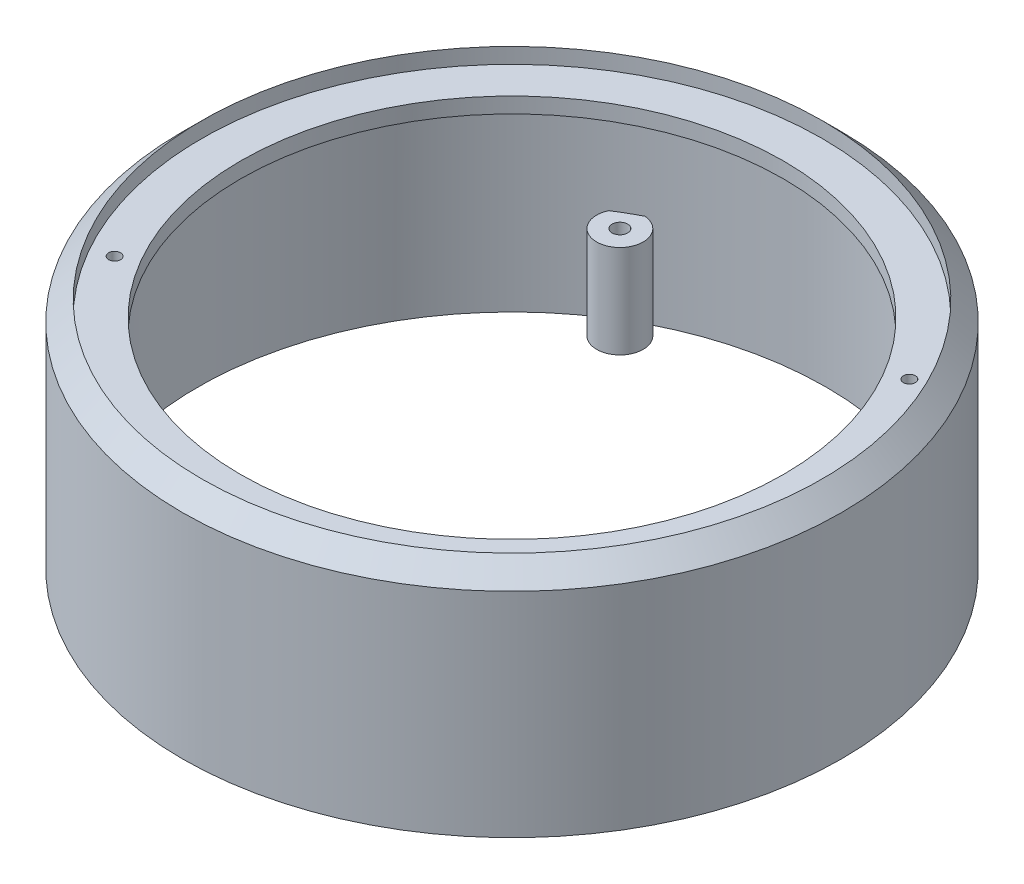
ISO-10303-21;
HEADER;
FILE_DESCRIPTION(('STEP AP214'),'2;1');
FILE_NAME('part.step','',(''),(''),'','','');
FILE_SCHEMA(('AUTOMOTIVE_DESIGN { 1 0 10303 214 1 1 1 1 }'));
ENDSEC;
DATA;
#1=APPLICATION_CONTEXT('core data for automotive mechanical design processes');
#2=APPLICATION_PROTOCOL_DEFINITION('international standard','automotive_design',2000,#1);
#3=PRODUCT_CONTEXT('',#1,'mechanical');
#4=PRODUCT('Part','Part','',(#3));
#5=PRODUCT_RELATED_PRODUCT_CATEGORY('part','',(#4));
#6=PRODUCT_DEFINITION_FORMATION('','',#4);
#7=PRODUCT_DEFINITION_CONTEXT('part definition',#1,'design');
#8=PRODUCT_DEFINITION('design','',#6,#7);
#9=PRODUCT_DEFINITION_SHAPE('','',#8);
#10=(LENGTH_UNIT() NAMED_UNIT(*) SI_UNIT(.MILLI.,.METRE.));
#11=(NAMED_UNIT(*) PLANE_ANGLE_UNIT() SI_UNIT($,.RADIAN.));
#12=(NAMED_UNIT(*) SI_UNIT($,.STERADIAN.) SOLID_ANGLE_UNIT());
#13=UNCERTAINTY_MEASURE_WITH_UNIT(LENGTH_MEASURE(1.E-05),#10,'distance_accuracy_value','');
#14=(GEOMETRIC_REPRESENTATION_CONTEXT(3) GLOBAL_UNCERTAINTY_ASSIGNED_CONTEXT((#13)) GLOBAL_UNIT_ASSIGNED_CONTEXT((#10,
#11,#12)) REPRESENTATION_CONTEXT('',''));
#15=CARTESIAN_POINT('',(0.,0.,0.));
#16=DIRECTION('',(0.,0.,1.));
#17=DIRECTION('',(1.,0.,0.));
#18=AXIS2_PLACEMENT_3D('',#15,#16,#17);
#19=CARTESIAN_POINT('',(-85.,0.,0.));
#20=DIRECTION('',(0.,1.,0.));
#21=DIRECTION('',(0.,0.,1.));
#22=AXIS2_PLACEMENT_3D('',#19,#20,#21);
#23=PLANE('',#22);
#24=CARTESIAN_POINT('',(0.,0.,0.));
#25=DIRECTION('',(0.,-1.,0.));
#26=DIRECTION('',(0.,0.,-1.));
#27=AXIS2_PLACEMENT_3D('',#24,#25,#26);
#28=CIRCLE('',#27,81.);
#29=CARTESIAN_POINT('',(-43.4284127716312,0.,68.3737739497888));
#30=VERTEX_POINT('',#29);
#31=CARTESIAN_POINT('',(-43.4284127716321,0.,-68.3737739497882));
#32=VERTEX_POINT('',#31);
#33=EDGE_CURVE('E11',#30,#32,#28,.T.);
#34=ORIENTED_EDGE('',*,*,#33,.F.);
#35=CARTESIAN_POINT('',(-37.9999999999994,0.,65.8179306876177));
#36=DIRECTION('',(0.,-1.,0.));
#37=DIRECTION('',(0.,0.,-1.));
#38=AXIS2_PLACEMENT_3D('',#35,#36,#37);
#39=CIRCLE('',#38,6.00000000000006);
#40=CARTESIAN_POINT('',(-37.4992188073149,0.,71.7969956811643));
#41=VERTEX_POINT('',#40);
#42=EDGE_CURVE('E89',#30,#41,#39,.T.);
#43=ORIENTED_EDGE('',*,*,#42,.T.);
#44=CARTESIAN_POINT('',(80.9276315789474,0.,3.4232217313755));
#45=VERTEX_POINT('',#44);
#46=EDGE_CURVE('E42',#45,#41,#28,.T.);
#47=ORIENTED_EDGE('',*,*,#46,.F.);
#48=CARTESIAN_POINT('',(76.,0.,0.));
#49=DIRECTION('',(0.,-1.,0.));
#50=DIRECTION('',(0.,0.,-1.));
#51=AXIS2_PLACEMENT_3D('',#48,#49,#50);
#52=CIRCLE('',#51,6.00000000000006);
#53=CARTESIAN_POINT('',(80.9276315789474,0.,-3.4232217313755));
#54=VERTEX_POINT('',#53);
#55=EDGE_CURVE('E87',#45,#54,#52,.T.);
#56=ORIENTED_EDGE('',*,*,#55,.T.);
#57=CARTESIAN_POINT('',(-37.4992188073159,0.,-71.7969956811638));
#58=VERTEX_POINT('',#57);
#59=EDGE_CURVE('E41',#58,#54,#28,.T.);
#60=ORIENTED_EDGE('',*,*,#59,.F.);
#61=CARTESIAN_POINT('',(-38.0000000000003,0.,-65.8179306876172));
#62=DIRECTION('',(0.,-1.,0.));
#63=DIRECTION('',(0.,0.,-1.));
#64=AXIS2_PLACEMENT_3D('',#61,#62,#63);
#65=CIRCLE('',#64,6.00000000000007);
#66=EDGE_CURVE('E116',#58,#32,#65,.T.);
#67=ORIENTED_EDGE('',*,*,#66,.T.);
#68=EDGE_LOOP('',(#34,#43,#47,#56,#60,#67));
#69=FACE_BOUND('',#68,.T.);
#70=CARTESIAN_POINT('',(0.,0.,0.));
#71=DIRECTION('',(0.,-1.,0.));
#72=DIRECTION('',(0.,0.,-1.));
#73=AXIS2_PLACEMENT_3D('',#70,#71,#72);
#74=CIRCLE('',#73,85.);
#75=CARTESIAN_POINT('',(0.,0.,-85.));
#76=VERTEX_POINT('',#75);
#77=EDGE_CURVE('E148',#76,#76,#74,.T.);
#78=ORIENTED_EDGE('',*,*,#77,.T.);
#79=EDGE_LOOP('',(#78));
#80=FACE_BOUND('',#79,.T.);
#81=CARTESIAN_POINT('',(-37.9999999999994,0.,65.8179306876177));
#82=DIRECTION('',(0.,-1.,0.));
#83=DIRECTION('',(0.,0.,-1.));
#84=AXIS2_PLACEMENT_3D('',#81,#82,#83);
#85=CIRCLE('',#84,2.);
#86=CARTESIAN_POINT('',(-37.9999999999994,0.,63.8179306876177));
#87=VERTEX_POINT('',#86);
#88=EDGE_CURVE('E130',#87,#87,#85,.T.);
#89=ORIENTED_EDGE('',*,*,#88,.F.);
#90=EDGE_LOOP('',(#89));
#91=FACE_BOUND('',#90,.T.);
#92=CARTESIAN_POINT('',(-38.0000000000003,0.,-65.8179306876172));
#93=DIRECTION('',(0.,-1.,0.));
#94=DIRECTION('',(0.,0.,-1.));
#95=AXIS2_PLACEMENT_3D('',#92,#93,#94);
#96=CIRCLE('',#95,2.);
#97=CARTESIAN_POINT('',(-38.0000000000003,0.,-67.8179306876172));
#98=VERTEX_POINT('',#97);
#99=EDGE_CURVE('E110',#98,#98,#96,.T.);
#100=ORIENTED_EDGE('',*,*,#99,.F.);
#101=EDGE_LOOP('',(#100));
#102=FACE_BOUND('',#101,.T.);
#103=CARTESIAN_POINT('',(76.,0.,0.));
#104=DIRECTION('',(0.,-1.,0.));
#105=DIRECTION('',(0.,0.,-1.));
#106=AXIS2_PLACEMENT_3D('',#103,#104,#105);
#107=CIRCLE('',#106,2.);
#108=CARTESIAN_POINT('',(76.,0.,-2.));
#109=VERTEX_POINT('',#108);
#110=EDGE_CURVE('E101',#109,#109,#107,.T.);
#111=ORIENTED_EDGE('',*,*,#110,.F.);
#112=EDGE_LOOP('',(#111));
#113=FACE_BOUND('',#112,.T.);
#114=ADVANCED_FACE('F34',(#69,#80,#91,#102,#113),#23,.F.);
#115=CARTESIAN_POINT('',(0.,-62.4634869454388,0.));
#116=DIRECTION('',(0.,-1.,0.));
#117=DIRECTION('',(0.,0.,-1.));
#118=AXIS2_PLACEMENT_3D('',#115,#116,#117);
#119=CYLINDRICAL_SURFACE('',#118,81.);
#120=CARTESIAN_POINT('',(0.,52.,0.));
#121=DIRECTION('',(0.,-1.,0.));
#122=DIRECTION('',(0.,0.,-1.));
#123=AXIS2_PLACEMENT_3D('',#120,#121,#122);
#124=CIRCLE('',#123,81.);
#125=CARTESIAN_POINT('',(0.,52.,-81.));
#126=VERTEX_POINT('',#125);
#127=EDGE_CURVE('E91',#126,#126,#124,.T.);
#128=ORIENTED_EDGE('',*,*,#127,.F.);
#129=EDGE_LOOP('',(#128));
#130=FACE_BOUND('',#129,.T.);
#131=CARTESIAN_POINT('',(0.,24.,0.));
#132=DIRECTION('',(0.,-1.,0.));
#133=DIRECTION('',(0.,0.,-1.));
#134=AXIS2_PLACEMENT_3D('',#131,#132,#133);
#135=CIRCLE('',#134,81.);
#136=CARTESIAN_POINT('',(80.9276315789474,24.,3.4232217313755));
#137=VERTEX_POINT('',#136);
#138=CARTESIAN_POINT('',(80.9276315789474,24.,-3.4232217313755));
#139=VERTEX_POINT('',#138);
#140=EDGE_CURVE('E53',#137,#139,#135,.F.);
#141=ORIENTED_EDGE('',*,*,#140,.F.);
#142=DIRECTION('',(0.,-1.,0.));
#143=VECTOR('',#142,1.);
#144=CARTESIAN_POINT('',(80.9276315789474,24.,3.4232217313755));
#145=LINE('',#144,#143);
#146=EDGE_CURVE('E92',#137,#45,#145,.T.);
#147=ORIENTED_EDGE('',*,*,#146,.T.);
#148=ORIENTED_EDGE('',*,*,#46,.T.);
#149=DIRECTION('',(0.,-1.,0.));
#150=VECTOR('',#149,1.);
#151=CARTESIAN_POINT('',(-37.4992188073149,24.,71.7969956811643));
#152=LINE('',#151,#150);
#153=CARTESIAN_POINT('',(-37.4992188073149,24.,71.7969956811643));
#154=VERTEX_POINT('',#153);
#155=EDGE_CURVE('E146',#154,#41,#152,.T.);
#156=ORIENTED_EDGE('',*,*,#155,.F.);
#157=CARTESIAN_POINT('',(0.,24.,0.));
#158=DIRECTION('',(0.,-1.,0.));
#159=DIRECTION('',(0.,0.,-1.));
#160=AXIS2_PLACEMENT_3D('',#157,#158,#159);
#161=CIRCLE('',#160,81.);
#162=CARTESIAN_POINT('',(-43.4284127716312,24.,68.3737739497888));
#163=VERTEX_POINT('',#162);
#164=EDGE_CURVE('E136',#163,#154,#161,.F.);
#165=ORIENTED_EDGE('',*,*,#164,.F.);
#166=DIRECTION('',(0.,-1.,0.));
#167=VECTOR('',#166,1.);
#168=CARTESIAN_POINT('',(-43.4284127716312,24.,68.3737739497888));
#169=LINE('',#168,#167);
#170=EDGE_CURVE('E142',#163,#30,#169,.T.);
#171=ORIENTED_EDGE('',*,*,#170,.T.);
#172=ORIENTED_EDGE('',*,*,#33,.T.);
#173=DIRECTION('',(0.,-1.,0.));
#174=VECTOR('',#173,1.);
#175=CARTESIAN_POINT('',(-43.4284127716321,24.,-68.3737739497882));
#176=LINE('',#175,#174);
#177=CARTESIAN_POINT('',(-43.4284127716321,24.,-68.3737739497882));
#178=VERTEX_POINT('',#177);
#179=EDGE_CURVE('E127',#178,#32,#176,.T.);
#180=ORIENTED_EDGE('',*,*,#179,.F.);
#181=CARTESIAN_POINT('',(0.,24.,0.));
#182=DIRECTION('',(0.,-1.,0.));
#183=DIRECTION('',(0.,0.,-1.));
#184=AXIS2_PLACEMENT_3D('',#181,#182,#183);
#185=CIRCLE('',#184,81.);
#186=CARTESIAN_POINT('',(-37.4992188073159,24.,-71.7969956811638));
#187=VERTEX_POINT('',#186);
#188=EDGE_CURVE('E115',#187,#178,#185,.F.);
#189=ORIENTED_EDGE('',*,*,#188,.F.);
#190=DIRECTION('',(0.,-1.,0.));
#191=VECTOR('',#190,1.);
#192=CARTESIAN_POINT('',(-37.4992188073159,24.,-71.7969956811638));
#193=LINE('',#192,#191);
#194=EDGE_CURVE('E122',#187,#58,#193,.T.);
#195=ORIENTED_EDGE('',*,*,#194,.T.);
#196=ORIENTED_EDGE('',*,*,#59,.T.);
#197=DIRECTION('',(0.,-1.,0.));
#198=VECTOR('',#197,1.);
#199=CARTESIAN_POINT('',(80.9276315789474,24.,-3.4232217313755));
#200=LINE('',#199,#198);
#201=EDGE_CURVE('E49',#139,#54,#200,.T.);
#202=ORIENTED_EDGE('',*,*,#201,.F.);
#203=EDGE_LOOP('',(#141,#147,#148,#156,#165,#171,#172,#180,#189,#195,#196,#202));
#204=FACE_BOUND('',#203,.T.);
#205=ADVANCED_FACE('F93',(#130,#204),#119,.F.);
#206=CARTESIAN_POINT('',(-81.,52.,0.));
#207=DIRECTION('',(0.,1.,0.));
#208=DIRECTION('',(0.,0.,1.));
#209=AXIS2_PLACEMENT_3D('',#206,#207,#208);
#210=PLANE('',#209);
#211=CARTESIAN_POINT('',(-64.9519052838328,52.,37.5000000000001));
#212=DIRECTION('',(0.,1.,0.));
#213=DIRECTION('',(0.,0.,1.));
#214=AXIS2_PLACEMENT_3D('',#211,#212,#213);
#215=CIRCLE('',#214,1.54999999999999);
#216=CARTESIAN_POINT('',(-64.9519052838328,52.,39.0500000000001));
#217=VERTEX_POINT('',#216);
#218=EDGE_CURVE('E106',#217,#217,#215,.T.);
#219=ORIENTED_EDGE('',*,*,#218,.T.);
#220=EDGE_LOOP('',(#219));
#221=FACE_BOUND('',#220,.T.);
#222=CARTESIAN_POINT('',(64.9519052838329,52.,-37.5000000000001));
#223=DIRECTION('',(0.,1.,0.));
#224=DIRECTION('',(0.,0.,1.));
#225=AXIS2_PLACEMENT_3D('',#222,#223,#224);
#226=CIRCLE('',#225,1.54999999999999);
#227=CARTESIAN_POINT('',(64.9519052838329,52.,-35.9500000000001));
#228=VERTEX_POINT('',#227);
#229=EDGE_CURVE('E249',#228,#228,#226,.T.);
#230=ORIENTED_EDGE('',*,*,#229,.T.);
#231=EDGE_LOOP('',(#230));
#232=FACE_BOUND('',#231,.T.);
#233=CARTESIAN_POINT('',(0.,52.,0.));
#234=DIRECTION('',(0.,-1.,0.));
#235=DIRECTION('',(0.,0.,-1.));
#236=AXIS2_PLACEMENT_3D('',#233,#234,#235);
#237=CIRCLE('',#236,70.);
#238=CARTESIAN_POINT('',(0.,52.,-70.));
#239=VERTEX_POINT('',#238);
#240=EDGE_CURVE('E165',#239,#239,#237,.T.);
#241=ORIENTED_EDGE('',*,*,#240,.F.);
#242=EDGE_LOOP('',(#241));
#243=FACE_BOUND('',#242,.T.);
#244=ORIENTED_EDGE('',*,*,#127,.T.);
#245=EDGE_LOOP('',(#244));
#246=FACE_BOUND('',#245,.T.);
#247=ADVANCED_FACE('F170',(#221,#232,#243,#246),#210,.F.);
#248=CARTESIAN_POINT('',(0.,-62.4634869454388,0.));
#249=DIRECTION('',(0.,-1.,0.));
#250=DIRECTION('',(0.,0.,-1.));
#251=AXIS2_PLACEMENT_3D('',#248,#249,#250);
#252=CYLINDRICAL_SURFACE('',#251,70.);
#253=CARTESIAN_POINT('',(0.,56.,0.));
#254=DIRECTION('',(0.,-1.,0.));
#255=DIRECTION('',(0.,0.,-1.));
#256=AXIS2_PLACEMENT_3D('',#253,#254,#255);
#257=CIRCLE('',#256,70.);
#258=CARTESIAN_POINT('',(0.,56.,-70.));
#259=VERTEX_POINT('',#258);
#260=EDGE_CURVE('E162',#259,#259,#257,.T.);
#261=ORIENTED_EDGE('',*,*,#260,.F.);
#262=EDGE_LOOP('',(#261));
#263=FACE_BOUND('',#262,.T.);
#264=ORIENTED_EDGE('',*,*,#240,.T.);
#265=EDGE_LOOP('',(#264));
#266=FACE_BOUND('',#265,.T.);
#267=ADVANCED_FACE('F177',(#263,#266),#252,.F.);
#268=CARTESIAN_POINT('',(-70.,56.,0.));
#269=DIRECTION('',(0.,-1.,0.));
#270=DIRECTION('',(0.,0.,-1.));
#271=AXIS2_PLACEMENT_3D('',#268,#269,#270);
#272=PLANE('',#271);
#273=CARTESIAN_POINT('',(-64.9519052838328,56.,37.5000000000001));
#274=DIRECTION('',(0.,1.,0.));
#275=DIRECTION('',(0.,0.,1.));
#276=AXIS2_PLACEMENT_3D('',#273,#274,#275);
#277=CIRCLE('',#276,1.54999999999999);
#278=CARTESIAN_POINT('',(-64.9519052838328,56.,39.0500000000001));
#279=VERTEX_POINT('',#278);
#280=EDGE_CURVE('E246',#279,#279,#277,.T.);
#281=ORIENTED_EDGE('',*,*,#280,.F.);
#282=EDGE_LOOP('',(#281));
#283=FACE_BOUND('',#282,.T.);
#284=CARTESIAN_POINT('',(64.9519052838329,56.,-37.5000000000001));
#285=DIRECTION('',(0.,1.,0.));
#286=DIRECTION('',(0.,0.,1.));
#287=AXIS2_PLACEMENT_3D('',#284,#285,#286);
#288=CIRCLE('',#287,1.54999999999999);
#289=CARTESIAN_POINT('',(64.9519052838329,56.,-35.9500000000001));
#290=VERTEX_POINT('',#289);
#291=EDGE_CURVE('E256',#290,#290,#288,.T.);
#292=ORIENTED_EDGE('',*,*,#291,.F.);
#293=EDGE_LOOP('',(#292));
#294=FACE_BOUND('',#293,.T.);
#295=CARTESIAN_POINT('',(0.,56.,0.));
#296=DIRECTION('',(0.,-1.,0.));
#297=DIRECTION('',(0.,0.,-1.));
#298=AXIS2_PLACEMENT_3D('',#295,#296,#297);
#299=CIRCLE('',#298,80.);
#300=CARTESIAN_POINT('',(0.,56.,-80.));
#301=VERTEX_POINT('',#300);
#302=EDGE_CURVE('E159',#301,#301,#299,.T.);
#303=ORIENTED_EDGE('',*,*,#302,.F.);
#304=EDGE_LOOP('',(#303));
#305=FACE_BOUND('',#304,.T.);
#306=ORIENTED_EDGE('',*,*,#260,.T.);
#307=EDGE_LOOP('',(#306));
#308=FACE_BOUND('',#307,.T.);
#309=ADVANCED_FACE('F183',(#283,#294,#305,#308),#272,.F.);
#310=CARTESIAN_POINT('',(0.,-62.4634869454388,0.));
#311=DIRECTION('',(0.,-1.,0.));
#312=DIRECTION('',(0.,0.,-1.));
#313=AXIS2_PLACEMENT_3D('',#310,#311,#312);
#314=CYLINDRICAL_SURFACE('',#313,80.);
#315=CARTESIAN_POINT('',(0.,60.,0.));
#316=DIRECTION('',(0.,-1.,0.));
#317=DIRECTION('',(0.,0.,-1.));
#318=AXIS2_PLACEMENT_3D('',#315,#316,#317);
#319=CIRCLE('',#318,80.);
#320=CARTESIAN_POINT('',(0.,60.,-80.));
#321=VERTEX_POINT('',#320);
#322=EDGE_CURVE('E156',#321,#321,#319,.T.);
#323=ORIENTED_EDGE('',*,*,#322,.F.);
#324=EDGE_LOOP('',(#323));
#325=FACE_BOUND('',#324,.T.);
#326=ORIENTED_EDGE('',*,*,#302,.T.);
#327=EDGE_LOOP('',(#326));
#328=FACE_BOUND('',#327,.T.);
#329=ADVANCED_FACE('F187',(#325,#328),#314,.F.);
#330=CARTESIAN_POINT('',(0.,60.,0.));
#331=DIRECTION('',(0.,-1.,0.));
#332=DIRECTION('',(0.,0.,-1.));
#333=AXIS2_PLACEMENT_3D('',#330,#331,#332);
#334=CONICAL_SURFACE('',#333,80.,0.785398163397447);
#335=CARTESIAN_POINT('',(0.,55.,0.));
#336=DIRECTION('',(0.,-1.,0.));
#337=DIRECTION('',(0.,0.,-1.));
#338=AXIS2_PLACEMENT_3D('',#335,#336,#337);
#339=CIRCLE('',#338,85.);
#340=CARTESIAN_POINT('',(0.,55.,-85.));
#341=VERTEX_POINT('',#340);
#342=EDGE_CURVE('E153',#341,#341,#339,.T.);
#343=ORIENTED_EDGE('',*,*,#342,.F.);
#344=EDGE_LOOP('',(#343));
#345=FACE_BOUND('',#344,.T.);
#346=ORIENTED_EDGE('',*,*,#322,.T.);
#347=EDGE_LOOP('',(#346));
#348=FACE_BOUND('',#347,.T.);
#349=ADVANCED_FACE('F191',(#345,#348),#334,.T.);
#350=CARTESIAN_POINT('',(0.,-62.4634869454388,0.));
#351=DIRECTION('',(0.,-1.,0.));
#352=DIRECTION('',(0.,0.,-1.));
#353=AXIS2_PLACEMENT_3D('',#350,#351,#352);
#354=CYLINDRICAL_SURFACE('',#353,85.);
#355=ORIENTED_EDGE('',*,*,#77,.F.);
#356=EDGE_LOOP('',(#355));
#357=FACE_BOUND('',#356,.T.);
#358=ORIENTED_EDGE('',*,*,#342,.T.);
#359=EDGE_LOOP('',(#358));
#360=FACE_BOUND('',#359,.T.);
#361=ADVANCED_FACE('F195',(#357,#360),#354,.T.);
#362=CARTESIAN_POINT('',(-37.9999999999994,24.,65.8179306876177));
#363=DIRECTION('',(0.,-1.,0.));
#364=DIRECTION('',(0.,0.,-1.));
#365=AXIS2_PLACEMENT_3D('',#362,#363,#364);
#366=CYLINDRICAL_SURFACE('',#365,2.);
#367=CARTESIAN_POINT('',(-37.9999999999994,24.,65.8179306876177));
#368=DIRECTION('',(0.,-1.,0.));
#369=DIRECTION('',(0.,0.,-1.));
#370=AXIS2_PLACEMENT_3D('',#367,#368,#369);
#371=CIRCLE('',#370,2.);
#372=CARTESIAN_POINT('',(-37.9999999999994,24.,63.8179306876177));
#373=VERTEX_POINT('',#372);
#374=EDGE_CURVE('E133',#373,#373,#371,.T.);
#375=ORIENTED_EDGE('',*,*,#374,.F.);
#376=EDGE_LOOP('',(#375));
#377=FACE_BOUND('',#376,.T.);
#378=ORIENTED_EDGE('',*,*,#88,.T.);
#379=EDGE_LOOP('',(#378));
#380=FACE_BOUND('',#379,.T.);
#381=ADVANCED_FACE('F199',(#377,#380),#366,.F.);
#382=CARTESIAN_POINT('',(-37.9999999999994,24.,65.8179306876177));
#383=DIRECTION('',(0.,-1.,0.));
#384=DIRECTION('',(0.,0.,-1.));
#385=AXIS2_PLACEMENT_3D('',#382,#383,#384);
#386=CYLINDRICAL_SURFACE('',#385,6.00000000000006);
#387=ORIENTED_EDGE('',*,*,#42,.F.);
#388=ORIENTED_EDGE('',*,*,#170,.F.);
#389=CARTESIAN_POINT('',(-37.9999999999994,24.,65.8179306876177));
#390=DIRECTION('',(0.,-1.,0.));
#391=DIRECTION('',(0.,0.,-1.));
#392=AXIS2_PLACEMENT_3D('',#389,#390,#391);
#393=CIRCLE('',#392,6.00000000000006);
#394=EDGE_CURVE('E139',#163,#154,#393,.T.);
#395=ORIENTED_EDGE('',*,*,#394,.T.);
#396=ORIENTED_EDGE('',*,*,#155,.T.);
#397=EDGE_LOOP('',(#387,#388,#395,#396));
#398=FACE_BOUND('',#397,.T.);
#399=ADVANCED_FACE('F203',(#398),#386,.T.);
#400=CARTESIAN_POINT('',(0.,24.,0.));
#401=DIRECTION('',(0.,-1.,0.));
#402=DIRECTION('',(0.,0.,-1.));
#403=AXIS2_PLACEMENT_3D('',#400,#401,#402);
#404=PLANE('',#403);
#405=ORIENTED_EDGE('',*,*,#374,.T.);
#406=EDGE_LOOP('',(#405));
#407=FACE_BOUND('',#406,.T.);
#408=ORIENTED_EDGE('',*,*,#164,.T.);
#409=ORIENTED_EDGE('',*,*,#394,.F.);
#410=EDGE_LOOP('',(#408,#409));
#411=FACE_BOUND('',#410,.T.);
#412=ADVANCED_FACE('F207',(#407,#411),#404,.F.);
#413=CARTESIAN_POINT('',(-38.0000000000003,24.,-65.8179306876172));
#414=DIRECTION('',(0.,-1.,0.));
#415=DIRECTION('',(0.,0.,-1.));
#416=AXIS2_PLACEMENT_3D('',#413,#414,#415);
#417=CYLINDRICAL_SURFACE('',#416,2.);
#418=CARTESIAN_POINT('',(-38.0000000000003,24.,-65.8179306876172));
#419=DIRECTION('',(0.,-1.,0.));
#420=DIRECTION('',(0.,0.,-1.));
#421=AXIS2_PLACEMENT_3D('',#418,#419,#420);
#422=CIRCLE('',#421,2.);
#423=CARTESIAN_POINT('',(-38.0000000000003,24.,-67.8179306876172));
#424=VERTEX_POINT('',#423);
#425=EDGE_CURVE('E112',#424,#424,#422,.T.);
#426=ORIENTED_EDGE('',*,*,#425,.F.);
#427=EDGE_LOOP('',(#426));
#428=FACE_BOUND('',#427,.T.);
#429=ORIENTED_EDGE('',*,*,#99,.T.);
#430=EDGE_LOOP('',(#429));
#431=FACE_BOUND('',#430,.T.);
#432=ADVANCED_FACE('F211',(#428,#431),#417,.F.);
#433=CARTESIAN_POINT('',(-38.0000000000003,24.,-65.8179306876172));
#434=DIRECTION('',(0.,-1.,0.));
#435=DIRECTION('',(0.,0.,-1.));
#436=AXIS2_PLACEMENT_3D('',#433,#434,#435);
#437=CYLINDRICAL_SURFACE('',#436,6.00000000000007);
#438=ORIENTED_EDGE('',*,*,#66,.F.);
#439=ORIENTED_EDGE('',*,*,#194,.F.);
#440=CARTESIAN_POINT('',(-38.0000000000003,24.,-65.8179306876172));
#441=DIRECTION('',(0.,-1.,0.));
#442=DIRECTION('',(0.,0.,-1.));
#443=AXIS2_PLACEMENT_3D('',#440,#441,#442);
#444=CIRCLE('',#443,6.00000000000007);
#445=EDGE_CURVE('E119',#187,#178,#444,.T.);
#446=ORIENTED_EDGE('',*,*,#445,.T.);
#447=ORIENTED_EDGE('',*,*,#179,.T.);
#448=EDGE_LOOP('',(#438,#439,#446,#447));
#449=FACE_BOUND('',#448,.T.);
#450=ADVANCED_FACE('F215',(#449),#437,.T.);
#451=CARTESIAN_POINT('',(0.,24.,0.));
#452=DIRECTION('',(0.,-1.,0.));
#453=DIRECTION('',(0.,0.,-1.));
#454=AXIS2_PLACEMENT_3D('',#451,#452,#453);
#455=PLANE('',#454);
#456=ORIENTED_EDGE('',*,*,#425,.T.);
#457=EDGE_LOOP('',(#456));
#458=FACE_BOUND('',#457,.T.);
#459=ORIENTED_EDGE('',*,*,#188,.T.);
#460=ORIENTED_EDGE('',*,*,#445,.F.);
#461=EDGE_LOOP('',(#459,#460));
#462=FACE_BOUND('',#461,.T.);
#463=ADVANCED_FACE('F219',(#458,#462),#455,.F.);
#464=CARTESIAN_POINT('',(76.,24.,0.));
#465=DIRECTION('',(0.,-1.,0.));
#466=DIRECTION('',(0.,0.,-1.));
#467=AXIS2_PLACEMENT_3D('',#464,#465,#466);
#468=CYLINDRICAL_SURFACE('',#467,2.);
#469=CARTESIAN_POINT('',(76.,24.,0.));
#470=DIRECTION('',(0.,-1.,0.));
#471=DIRECTION('',(0.,0.,-1.));
#472=AXIS2_PLACEMENT_3D('',#469,#470,#471);
#473=CIRCLE('',#472,2.);
#474=CARTESIAN_POINT('',(76.,24.,-2.));
#475=VERTEX_POINT('',#474);
#476=EDGE_CURVE('E100',#475,#475,#473,.T.);
#477=ORIENTED_EDGE('',*,*,#476,.F.);
#478=EDGE_LOOP('',(#477));
#479=FACE_BOUND('',#478,.T.);
#480=ORIENTED_EDGE('',*,*,#110,.T.);
#481=EDGE_LOOP('',(#480));
#482=FACE_BOUND('',#481,.T.);
#483=ADVANCED_FACE('F223',(#479,#482),#468,.F.);
#484=CARTESIAN_POINT('',(76.,24.,0.));
#485=DIRECTION('',(0.,-1.,0.));
#486=DIRECTION('',(0.,0.,-1.));
#487=AXIS2_PLACEMENT_3D('',#484,#485,#486);
#488=CYLINDRICAL_SURFACE('',#487,6.00000000000006);
#489=ORIENTED_EDGE('',*,*,#55,.F.);
#490=ORIENTED_EDGE('',*,*,#146,.F.);
#491=CARTESIAN_POINT('',(76.,24.,0.));
#492=DIRECTION('',(0.,-1.,0.));
#493=DIRECTION('',(0.,0.,-1.));
#494=AXIS2_PLACEMENT_3D('',#491,#492,#493);
#495=CIRCLE('',#494,6.00000000000006);
#496=EDGE_CURVE('E97',#137,#139,#495,.T.);
#497=ORIENTED_EDGE('',*,*,#496,.T.);
#498=ORIENTED_EDGE('',*,*,#201,.T.);
#499=EDGE_LOOP('',(#489,#490,#497,#498));
#500=FACE_BOUND('',#499,.T.);
#501=ADVANCED_FACE('F99',(#500),#488,.T.);
#502=CARTESIAN_POINT('',(0.,24.,0.));
#503=DIRECTION('',(0.,-1.,0.));
#504=DIRECTION('',(0.,0.,-1.));
#505=AXIS2_PLACEMENT_3D('',#502,#503,#504);
#506=PLANE('',#505);
#507=ORIENTED_EDGE('',*,*,#476,.T.);
#508=EDGE_LOOP('',(#507));
#509=FACE_BOUND('',#508,.T.);
#510=ORIENTED_EDGE('',*,*,#140,.T.);
#511=ORIENTED_EDGE('',*,*,#496,.F.);
#512=EDGE_LOOP('',(#510,#511));
#513=FACE_BOUND('',#512,.T.);
#514=ADVANCED_FACE('F230',(#509,#513),#506,.F.);
#515=CARTESIAN_POINT('',(64.9519052838329,46.,-37.5000000000001));
#516=DIRECTION('',(0.,1.,0.));
#517=DIRECTION('',(0.,0.,1.));
#518=AXIS2_PLACEMENT_3D('',#515,#516,#517);
#519=CYLINDRICAL_SURFACE('',#518,1.54999999999999);
#520=ORIENTED_EDGE('',*,*,#291,.T.);
#521=EDGE_LOOP('',(#520));
#522=FACE_BOUND('',#521,.T.);
#523=ORIENTED_EDGE('',*,*,#229,.F.);
#524=EDGE_LOOP('',(#523));
#525=FACE_BOUND('',#524,.T.);
#526=ADVANCED_FACE('F233',(#522,#525),#519,.F.);
#527=CARTESIAN_POINT('',(-64.9519052838328,46.,37.5000000000001));
#528=DIRECTION('',(0.,1.,0.));
#529=DIRECTION('',(0.,0.,1.));
#530=AXIS2_PLACEMENT_3D('',#527,#528,#529);
#531=CYLINDRICAL_SURFACE('',#530,1.54999999999999);
#532=ORIENTED_EDGE('',*,*,#280,.T.);
#533=EDGE_LOOP('',(#532));
#534=FACE_BOUND('',#533,.T.);
#535=ORIENTED_EDGE('',*,*,#218,.F.);
#536=EDGE_LOOP('',(#535));
#537=FACE_BOUND('',#536,.T.);
#538=ADVANCED_FACE('F237',(#534,#537),#531,.F.);
#539=CLOSED_SHELL('',(#114,#205,#247,#267,#309,#329,#349,#361,#381,#399,#412,#432,#450,#463,
#483,#501,#514,#526,#538));
#540=MANIFOLD_SOLID_BREP('B2',#539);
#541=ADVANCED_BREP_SHAPE_REPRESENTATION('',(#18,#540),#14);
#542=SHAPE_DEFINITION_REPRESENTATION(#9,#541);
ENDSEC;
END-ISO-10303-21;
